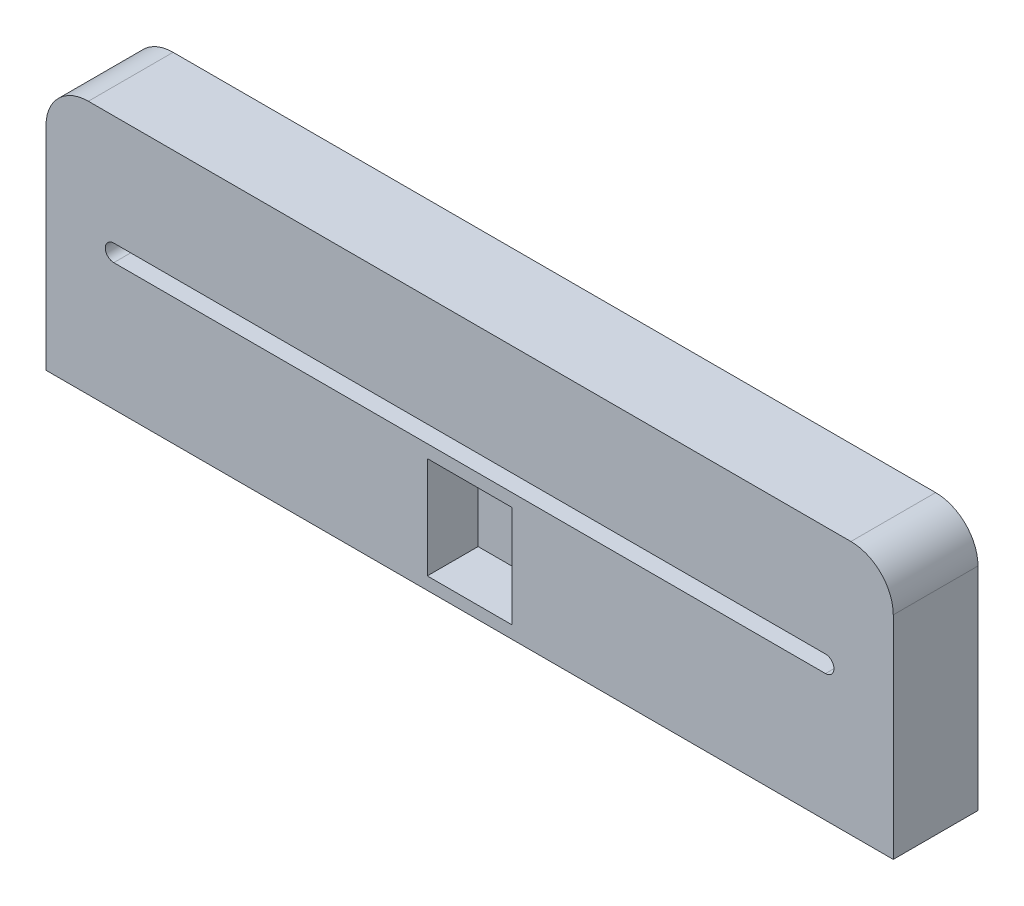
ISO-10303-21;
HEADER;
FILE_DESCRIPTION(('STEP AP214'),'2;1');
FILE_NAME('part.step','',(''),(''),'','','');
FILE_SCHEMA(('AUTOMOTIVE_DESIGN { 1 0 10303 214 1 1 1 1 }'));
ENDSEC;
DATA;
#1=APPLICATION_CONTEXT('core data for automotive mechanical design processes');
#2=APPLICATION_PROTOCOL_DEFINITION('international standard','automotive_design',2000,#1);
#3=PRODUCT_CONTEXT('',#1,'mechanical');
#4=PRODUCT('Part','Part','',(#3));
#5=PRODUCT_RELATED_PRODUCT_CATEGORY('part','',(#4));
#6=PRODUCT_DEFINITION_FORMATION('','',#4);
#7=PRODUCT_DEFINITION_CONTEXT('part definition',#1,'design');
#8=PRODUCT_DEFINITION('design','',#6,#7);
#9=PRODUCT_DEFINITION_SHAPE('','',#8);
#10=(LENGTH_UNIT() NAMED_UNIT(*) SI_UNIT(.MILLI.,.METRE.));
#11=(NAMED_UNIT(*) PLANE_ANGLE_UNIT() SI_UNIT($,.RADIAN.));
#12=(NAMED_UNIT(*) SI_UNIT($,.STERADIAN.) SOLID_ANGLE_UNIT());
#13=UNCERTAINTY_MEASURE_WITH_UNIT(LENGTH_MEASURE(1.E-05),#10,'distance_accuracy_value','');
#14=(GEOMETRIC_REPRESENTATION_CONTEXT(3) GLOBAL_UNCERTAINTY_ASSIGNED_CONTEXT((#13)) GLOBAL_UNIT_ASSIGNED_CONTEXT((#10,
#11,#12)) REPRESENTATION_CONTEXT('',''));
#15=CARTESIAN_POINT('',(0.,0.,0.));
#16=DIRECTION('',(0.,0.,1.));
#17=DIRECTION('',(1.,0.,0.));
#18=AXIS2_PLACEMENT_3D('',#15,#16,#17);
#19=CARTESIAN_POINT('',(25.,0.,5.));
#20=DIRECTION('',(1.,0.,0.));
#21=DIRECTION('',(0.,0.,-1.));
#22=AXIS2_PLACEMENT_3D('',#19,#20,#21);
#23=PLANE('',#22);
#24=DIRECTION('',(0.,-1.,0.));
#25=VECTOR('',#24,1.);
#26=CARTESIAN_POINT('',(25.,0.,0.));
#27=LINE('',#26,#25);
#28=CARTESIAN_POINT('',(25.,5.,0.));
#29=VERTEX_POINT('',#28);
#30=CARTESIAN_POINT('',(25.,-7.5,0.));
#31=VERTEX_POINT('',#30);
#32=EDGE_CURVE('E255',#29,#31,#27,.T.);
#33=ORIENTED_EDGE('',*,*,#32,.F.);
#34=DIRECTION('',(0.,0.,-1.));
#35=VECTOR('',#34,1.);
#36=CARTESIAN_POINT('',(25.,5.,5.));
#37=LINE('',#36,#35);
#38=CARTESIAN_POINT('',(25.,5.,5.));
#39=VERTEX_POINT('',#38);
#40=EDGE_CURVE('E11',#29,#39,#37,.F.);
#41=ORIENTED_EDGE('',*,*,#40,.T.);
#42=DIRECTION('',(0.,-1.,0.));
#43=VECTOR('',#42,1.);
#44=CARTESIAN_POINT('',(25.,0.,5.));
#45=LINE('',#44,#43);
#46=CARTESIAN_POINT('',(25.,-7.5,5.));
#47=VERTEX_POINT('',#46);
#48=EDGE_CURVE('E256',#39,#47,#45,.T.);
#49=ORIENTED_EDGE('',*,*,#48,.T.);
#50=DIRECTION('',(0.,0.,-1.));
#51=VECTOR('',#50,1.);
#52=CARTESIAN_POINT('',(25.,-7.5,5.));
#53=LINE('',#52,#51);
#54=EDGE_CURVE('E267',#47,#31,#53,.T.);
#55=ORIENTED_EDGE('',*,*,#54,.T.);
#56=EDGE_LOOP('',(#33,#41,#49,#55));
#57=FACE_BOUND('',#56,.T.);
#58=ADVANCED_FACE('F33',(#57),#23,.T.);
#59=CARTESIAN_POINT('',(0.,7.5,5.));
#60=DIRECTION('',(0.,1.,0.));
#61=DIRECTION('',(0.,0.,1.));
#62=AXIS2_PLACEMENT_3D('',#59,#60,#61);
#63=PLANE('',#62);
#64=DIRECTION('',(1.,0.,0.));
#65=VECTOR('',#64,1.);
#66=CARTESIAN_POINT('',(0.,7.5,0.));
#67=LINE('',#66,#65);
#68=CARTESIAN_POINT('',(-22.5,7.5,0.));
#69=VERTEX_POINT('',#68);
#70=CARTESIAN_POINT('',(22.5,7.5,0.));
#71=VERTEX_POINT('',#70);
#72=EDGE_CURVE('E269',#69,#71,#67,.T.);
#73=ORIENTED_EDGE('',*,*,#72,.F.);
#74=DIRECTION('',(0.,0.,-1.));
#75=VECTOR('',#74,1.);
#76=CARTESIAN_POINT('',(-22.5,7.5,5.));
#77=LINE('',#76,#75);
#78=CARTESIAN_POINT('',(-22.5,7.5,5.));
#79=VERTEX_POINT('',#78);
#80=EDGE_CURVE('E291',#69,#79,#77,.F.);
#81=ORIENTED_EDGE('',*,*,#80,.T.);
#82=DIRECTION('',(1.,0.,0.));
#83=VECTOR('',#82,1.);
#84=CARTESIAN_POINT('',(0.,7.5,5.));
#85=LINE('',#84,#83);
#86=CARTESIAN_POINT('',(22.5,7.5,5.));
#87=VERTEX_POINT('',#86);
#88=EDGE_CURVE('E258',#79,#87,#85,.T.);
#89=ORIENTED_EDGE('',*,*,#88,.T.);
#90=DIRECTION('',(0.,0.,-1.));
#91=VECTOR('',#90,1.);
#92=CARTESIAN_POINT('',(22.5,7.5,5.));
#93=LINE('',#92,#91);
#94=EDGE_CURVE('E288',#87,#71,#93,.T.);
#95=ORIENTED_EDGE('',*,*,#94,.T.);
#96=EDGE_LOOP('',(#73,#81,#89,#95));
#97=FACE_BOUND('',#96,.T.);
#98=ADVANCED_FACE('F313',(#97),#63,.T.);
#99=CARTESIAN_POINT('',(-25.,0.,5.));
#100=DIRECTION('',(1.,0.,0.));
#101=DIRECTION('',(0.,0.,-1.));
#102=AXIS2_PLACEMENT_3D('',#99,#100,#101);
#103=PLANE('',#102);
#104=DIRECTION('',(0.,-1.,0.));
#105=VECTOR('',#104,1.);
#106=CARTESIAN_POINT('',(-25.,0.,5.));
#107=LINE('',#106,#105);
#108=CARTESIAN_POINT('',(-25.,5.,5.));
#109=VERTEX_POINT('',#108);
#110=CARTESIAN_POINT('',(-25.,-7.5,5.));
#111=VERTEX_POINT('',#110);
#112=EDGE_CURVE('E262',#109,#111,#107,.T.);
#113=ORIENTED_EDGE('',*,*,#112,.F.);
#114=DIRECTION('',(0.,0.,-1.));
#115=VECTOR('',#114,1.);
#116=CARTESIAN_POINT('',(-25.,5.,0.));
#117=LINE('',#116,#115);
#118=CARTESIAN_POINT('',(-25.,5.,0.));
#119=VERTEX_POINT('',#118);
#120=EDGE_CURVE('E281',#109,#119,#117,.T.);
#121=ORIENTED_EDGE('',*,*,#120,.T.);
#122=DIRECTION('',(0.,-1.,0.));
#123=VECTOR('',#122,1.);
#124=CARTESIAN_POINT('',(-25.,0.,0.));
#125=LINE('',#124,#123);
#126=CARTESIAN_POINT('',(-25.,-7.5,0.));
#127=VERTEX_POINT('',#126);
#128=EDGE_CURVE('E272',#119,#127,#125,.T.);
#129=ORIENTED_EDGE('',*,*,#128,.T.);
#130=DIRECTION('',(0.,0.,-1.));
#131=VECTOR('',#130,1.);
#132=CARTESIAN_POINT('',(-25.,-7.5,5.));
#133=LINE('',#132,#131);
#134=EDGE_CURVE('E278',#111,#127,#133,.T.);
#135=ORIENTED_EDGE('',*,*,#134,.F.);
#136=EDGE_LOOP('',(#113,#121,#129,#135));
#137=FACE_BOUND('',#136,.T.);
#138=ADVANCED_FACE('F304',(#137),#103,.F.);
#139=CARTESIAN_POINT('',(0.,-7.5,5.));
#140=DIRECTION('',(0.,1.,0.));
#141=DIRECTION('',(0.,0.,1.));
#142=AXIS2_PLACEMENT_3D('',#139,#140,#141);
#143=PLANE('',#142);
#144=DIRECTION('',(1.,0.,0.));
#145=VECTOR('',#144,1.);
#146=CARTESIAN_POINT('',(0.,-7.5,0.));
#147=LINE('',#146,#145);
#148=EDGE_CURVE('E259',#127,#31,#147,.T.);
#149=ORIENTED_EDGE('',*,*,#148,.T.);
#150=ORIENTED_EDGE('',*,*,#54,.F.);
#151=DIRECTION('',(1.,0.,0.));
#152=VECTOR('',#151,1.);
#153=CARTESIAN_POINT('',(0.,-7.5,5.));
#154=LINE('',#153,#152);
#155=EDGE_CURVE('E264',#111,#47,#154,.T.);
#156=ORIENTED_EDGE('',*,*,#155,.F.);
#157=ORIENTED_EDGE('',*,*,#134,.T.);
#158=EDGE_LOOP('',(#149,#150,#156,#157));
#159=FACE_BOUND('',#158,.T.);
#160=ADVANCED_FACE('F323',(#159),#143,.F.);
#161=CARTESIAN_POINT('',(0.,0.,5.));
#162=DIRECTION('',(0.,0.,1.));
#163=DIRECTION('',(1.,0.,0.));
#164=AXIS2_PLACEMENT_3D('',#161,#162,#163);
#165=PLANE('',#164);
#166=DIRECTION('',(0.,1.,0.));
#167=VECTOR('',#166,1.);
#168=CARTESIAN_POINT('',(2.5,-0.760126057706259,5.));
#169=LINE('',#168,#167);
#170=CARTESIAN_POINT('',(2.5,-6.76012605770626,5.));
#171=VERTEX_POINT('',#170);
#172=CARTESIAN_POINT('',(2.5,-0.760126057706259,5.));
#173=VERTEX_POINT('',#172);
#174=EDGE_CURVE('E48',#171,#173,#169,.T.);
#175=ORIENTED_EDGE('',*,*,#174,.F.);
#176=DIRECTION('',(1.,0.,0.));
#177=VECTOR('',#176,1.);
#178=CARTESIAN_POINT('',(-2.5,-6.76012605770626,5.));
#179=LINE('',#178,#177);
#180=CARTESIAN_POINT('',(-2.5,-6.76012605770626,5.));
#181=VERTEX_POINT('',#180);
#182=EDGE_CURVE('E177',#181,#171,#179,.T.);
#183=ORIENTED_EDGE('',*,*,#182,.F.);
#184=DIRECTION('',(0.,-1.,0.));
#185=VECTOR('',#184,1.);
#186=CARTESIAN_POINT('',(-2.5,-0.760126057706259,5.));
#187=LINE('',#186,#185);
#188=CARTESIAN_POINT('',(-2.5,-0.760126057706259,5.));
#189=VERTEX_POINT('',#188);
#190=EDGE_CURVE('E180',#189,#181,#187,.T.);
#191=ORIENTED_EDGE('',*,*,#190,.F.);
#192=DIRECTION('',(-1.,0.,0.));
#193=VECTOR('',#192,1.);
#194=CARTESIAN_POINT('',(-2.5,-0.760126057706259,5.));
#195=LINE('',#194,#193);
#196=EDGE_CURVE('E186',#173,#189,#195,.T.);
#197=ORIENTED_EDGE('',*,*,#196,.F.);
#198=EDGE_LOOP('',(#175,#183,#191,#197));
#199=FACE_BOUND('',#198,.T.);
#200=CARTESIAN_POINT('',(21.,0.500000000000001,5.));
#201=DIRECTION('',(0.,0.,-1.));
#202=DIRECTION('',(-1.,0.,0.));
#203=AXIS2_PLACEMENT_3D('',#200,#201,#202);
#204=CIRCLE('',#203,0.5);
#205=CARTESIAN_POINT('',(21.,1.,5.));
#206=VERTEX_POINT('',#205);
#207=CARTESIAN_POINT('',(21.,0.,5.));
#208=VERTEX_POINT('',#207);
#209=EDGE_CURVE('E196',#206,#208,#204,.T.);
#210=ORIENTED_EDGE('',*,*,#209,.T.);
#211=DIRECTION('',(-1.,0.,0.));
#212=VECTOR('',#211,1.);
#213=CARTESIAN_POINT('',(21.,0.,5.));
#214=LINE('',#213,#212);
#215=CARTESIAN_POINT('',(-21.,0.,5.));
#216=VERTEX_POINT('',#215);
#217=EDGE_CURVE('E199',#208,#216,#214,.T.);
#218=ORIENTED_EDGE('',*,*,#217,.T.);
#219=CARTESIAN_POINT('',(-21.,0.500000000000001,5.));
#220=DIRECTION('',(0.,0.,-1.));
#221=DIRECTION('',(-1.,0.,0.));
#222=AXIS2_PLACEMENT_3D('',#219,#220,#221);
#223=CIRCLE('',#222,0.5);
#224=CARTESIAN_POINT('',(-21.,1.,5.));
#225=VERTEX_POINT('',#224);
#226=EDGE_CURVE('E56',#216,#225,#223,.T.);
#227=ORIENTED_EDGE('',*,*,#226,.T.);
#228=DIRECTION('',(1.,0.,0.));
#229=VECTOR('',#228,1.);
#230=CARTESIAN_POINT('',(21.,1.,5.));
#231=LINE('',#230,#229);
#232=EDGE_CURVE('E204',#225,#206,#231,.T.);
#233=ORIENTED_EDGE('',*,*,#232,.T.);
#234=EDGE_LOOP('',(#210,#218,#227,#233));
#235=FACE_BOUND('',#234,.T.);
#236=ORIENTED_EDGE('',*,*,#88,.F.);
#237=CARTESIAN_POINT('',(-22.5,5.,5.));
#238=DIRECTION('',(0.,0.,1.));
#239=DIRECTION('',(1.,0.,0.));
#240=AXIS2_PLACEMENT_3D('',#237,#238,#239);
#241=CIRCLE('',#240,2.5);
#242=EDGE_CURVE('E41',#79,#109,#241,.T.);
#243=ORIENTED_EDGE('',*,*,#242,.T.);
#244=ORIENTED_EDGE('',*,*,#112,.T.);
#245=ORIENTED_EDGE('',*,*,#155,.T.);
#246=ORIENTED_EDGE('',*,*,#48,.F.);
#247=CARTESIAN_POINT('',(22.5,5.,5.));
#248=DIRECTION('',(0.,0.,1.));
#249=DIRECTION('',(1.,0.,0.));
#250=AXIS2_PLACEMENT_3D('',#247,#248,#249);
#251=CIRCLE('',#250,2.5);
#252=EDGE_CURVE('E293',#39,#87,#251,.T.);
#253=ORIENTED_EDGE('',*,*,#252,.T.);
#254=EDGE_LOOP('',(#236,#243,#244,#245,#246,#253));
#255=FACE_BOUND('',#254,.T.);
#256=ADVANCED_FACE('F298',(#199,#235,#255),#165,.T.);
#257=CARTESIAN_POINT('',(0.,0.,0.));
#258=DIRECTION('',(0.,0.,1.));
#259=DIRECTION('',(1.,0.,0.));
#260=AXIS2_PLACEMENT_3D('',#257,#258,#259);
#261=PLANE('',#260);
#262=DIRECTION('',(1.,0.,0.));
#263=VECTOR('',#262,1.);
#264=CARTESIAN_POINT('',(0.,-0.499999999999999,0.));
#265=LINE('',#264,#263);
#266=CARTESIAN_POINT('',(-22.,-0.499999999999999,0.));
#267=VERTEX_POINT('',#266);
#268=CARTESIAN_POINT('',(22.,-0.499999999999999,0.));
#269=VERTEX_POINT('',#268);
#270=EDGE_CURVE('E230',#267,#269,#265,.T.);
#271=ORIENTED_EDGE('',*,*,#270,.T.);
#272=DIRECTION('',(0.,-1.,0.));
#273=VECTOR('',#272,1.);
#274=CARTESIAN_POINT('',(22.,0.,0.));
#275=LINE('',#274,#273);
#276=CARTESIAN_POINT('',(22.,4.5,0.));
#277=VERTEX_POINT('',#276);
#278=EDGE_CURVE('E219',#277,#269,#275,.T.);
#279=ORIENTED_EDGE('',*,*,#278,.F.);
#280=DIRECTION('',(1.,0.,0.));
#281=VECTOR('',#280,1.);
#282=CARTESIAN_POINT('',(0.,4.5,0.));
#283=LINE('',#282,#281);
#284=CARTESIAN_POINT('',(-22.,4.5,0.));
#285=VERTEX_POINT('',#284);
#286=EDGE_CURVE('E239',#285,#277,#283,.T.);
#287=ORIENTED_EDGE('',*,*,#286,.F.);
#288=DIRECTION('',(0.,-1.,0.));
#289=VECTOR('',#288,1.);
#290=CARTESIAN_POINT('',(-22.,0.,0.));
#291=LINE('',#290,#289);
#292=EDGE_CURVE('E242',#285,#267,#291,.T.);
#293=ORIENTED_EDGE('',*,*,#292,.T.);
#294=EDGE_LOOP('',(#271,#279,#287,#293));
#295=FACE_BOUND('',#294,.T.);
#296=ORIENTED_EDGE('',*,*,#128,.F.);
#297=CARTESIAN_POINT('',(-22.5,5.,0.));
#298=DIRECTION('',(0.,0.,1.));
#299=DIRECTION('',(1.,0.,0.));
#300=AXIS2_PLACEMENT_3D('',#297,#298,#299);
#301=CIRCLE('',#300,2.5);
#302=EDGE_CURVE('E286',#119,#69,#301,.F.);
#303=ORIENTED_EDGE('',*,*,#302,.T.);
#304=ORIENTED_EDGE('',*,*,#72,.T.);
#305=CARTESIAN_POINT('',(22.5,5.,0.));
#306=DIRECTION('',(0.,0.,1.));
#307=DIRECTION('',(1.,0.,0.));
#308=AXIS2_PLACEMENT_3D('',#305,#306,#307);
#309=CIRCLE('',#308,2.5);
#310=EDGE_CURVE('E284',#71,#29,#309,.F.);
#311=ORIENTED_EDGE('',*,*,#310,.T.);
#312=ORIENTED_EDGE('',*,*,#32,.T.);
#313=ORIENTED_EDGE('',*,*,#148,.F.);
#314=EDGE_LOOP('',(#296,#303,#304,#311,#312,#313));
#315=FACE_BOUND('',#314,.T.);
#316=ADVANCED_FACE('F310',(#295,#315),#261,.F.);
#317=CARTESIAN_POINT('',(22.,0.,2.));
#318=DIRECTION('',(1.,0.,0.));
#319=DIRECTION('',(0.,0.,-1.));
#320=AXIS2_PLACEMENT_3D('',#317,#318,#319);
#321=PLANE('',#320);
#322=ORIENTED_EDGE('',*,*,#278,.T.);
#323=DIRECTION('',(0.,0.,-1.));
#324=VECTOR('',#323,1.);
#325=CARTESIAN_POINT('',(22.,-0.499999999999999,2.));
#326=LINE('',#325,#324);
#327=CARTESIAN_POINT('',(22.,-0.499999999999999,2.));
#328=VERTEX_POINT('',#327);
#329=EDGE_CURVE('E237',#328,#269,#326,.T.);
#330=ORIENTED_EDGE('',*,*,#329,.F.);
#331=DIRECTION('',(0.,-1.,0.));
#332=VECTOR('',#331,1.);
#333=CARTESIAN_POINT('',(22.,0.,2.));
#334=LINE('',#333,#332);
#335=CARTESIAN_POINT('',(22.,4.5,2.));
#336=VERTEX_POINT('',#335);
#337=EDGE_CURVE('E226',#336,#328,#334,.T.);
#338=ORIENTED_EDGE('',*,*,#337,.F.);
#339=DIRECTION('',(0.,0.,-1.));
#340=VECTOR('',#339,1.);
#341=CARTESIAN_POINT('',(22.,4.5,2.));
#342=LINE('',#341,#340);
#343=EDGE_CURVE('E253',#336,#277,#342,.T.);
#344=ORIENTED_EDGE('',*,*,#343,.T.);
#345=EDGE_LOOP('',(#322,#330,#338,#344));
#346=FACE_BOUND('',#345,.T.);
#347=ADVANCED_FACE('F367',(#346),#321,.F.);
#348=CARTESIAN_POINT('',(0.,4.5,2.));
#349=DIRECTION('',(0.,1.,0.));
#350=DIRECTION('',(0.,0.,1.));
#351=AXIS2_PLACEMENT_3D('',#348,#349,#350);
#352=PLANE('',#351);
#353=ORIENTED_EDGE('',*,*,#286,.T.);
#354=ORIENTED_EDGE('',*,*,#343,.F.);
#355=DIRECTION('',(1.,0.,0.));
#356=VECTOR('',#355,1.);
#357=CARTESIAN_POINT('',(0.,4.5,2.));
#358=LINE('',#357,#356);
#359=CARTESIAN_POINT('',(-22.,4.5,2.));
#360=VERTEX_POINT('',#359);
#361=EDGE_CURVE('E229',#360,#336,#358,.T.);
#362=ORIENTED_EDGE('',*,*,#361,.F.);
#363=DIRECTION('',(0.,0.,-1.));
#364=VECTOR('',#363,1.);
#365=CARTESIAN_POINT('',(-22.,4.5,2.));
#366=LINE('',#365,#364);
#367=EDGE_CURVE('E251',#360,#285,#366,.T.);
#368=ORIENTED_EDGE('',*,*,#367,.T.);
#369=EDGE_LOOP('',(#353,#354,#362,#368));
#370=FACE_BOUND('',#369,.T.);
#371=ADVANCED_FACE('F363',(#370),#352,.F.);
#372=CARTESIAN_POINT('',(-22.,0.,2.));
#373=DIRECTION('',(1.,0.,0.));
#374=DIRECTION('',(0.,0.,-1.));
#375=AXIS2_PLACEMENT_3D('',#372,#373,#374);
#376=PLANE('',#375);
#377=ORIENTED_EDGE('',*,*,#292,.F.);
#378=ORIENTED_EDGE('',*,*,#367,.F.);
#379=DIRECTION('',(0.,-1.,0.));
#380=VECTOR('',#379,1.);
#381=CARTESIAN_POINT('',(-22.,0.,2.));
#382=LINE('',#381,#380);
#383=CARTESIAN_POINT('',(-22.,-0.499999999999999,2.));
#384=VERTEX_POINT('',#383);
#385=EDGE_CURVE('E233',#360,#384,#382,.T.);
#386=ORIENTED_EDGE('',*,*,#385,.T.);
#387=DIRECTION('',(0.,0.,-1.));
#388=VECTOR('',#387,1.);
#389=CARTESIAN_POINT('',(-22.,-0.499999999999999,2.));
#390=LINE('',#389,#388);
#391=EDGE_CURVE('E249',#384,#267,#390,.T.);
#392=ORIENTED_EDGE('',*,*,#391,.T.);
#393=EDGE_LOOP('',(#377,#378,#386,#392));
#394=FACE_BOUND('',#393,.T.);
#395=ADVANCED_FACE('F353',(#394),#376,.T.);
#396=CARTESIAN_POINT('',(0.,-0.499999999999999,2.));
#397=DIRECTION('',(0.,1.,0.));
#398=DIRECTION('',(0.,0.,1.));
#399=AXIS2_PLACEMENT_3D('',#396,#397,#398);
#400=PLANE('',#399);
#401=ORIENTED_EDGE('',*,*,#270,.F.);
#402=ORIENTED_EDGE('',*,*,#391,.F.);
#403=DIRECTION('',(1.,0.,0.));
#404=VECTOR('',#403,1.);
#405=CARTESIAN_POINT('',(0.,-0.499999999999999,2.));
#406=LINE('',#405,#404);
#407=EDGE_CURVE('E235',#384,#328,#406,.T.);
#408=ORIENTED_EDGE('',*,*,#407,.T.);
#409=ORIENTED_EDGE('',*,*,#329,.T.);
#410=EDGE_LOOP('',(#401,#402,#408,#409));
#411=FACE_BOUND('',#410,.T.);
#412=ADVANCED_FACE('F347',(#411),#400,.T.);
#413=CARTESIAN_POINT('',(0.,0.,2.));
#414=DIRECTION('',(0.,0.,1.));
#415=DIRECTION('',(1.,0.,0.));
#416=AXIS2_PLACEMENT_3D('',#413,#414,#415);
#417=PLANE('',#416);
#418=DIRECTION('',(-1.,0.,0.));
#419=VECTOR('',#418,1.);
#420=CARTESIAN_POINT('',(21.,0.,2.));
#421=LINE('',#420,#419);
#422=CARTESIAN_POINT('',(21.,0.,2.));
#423=VERTEX_POINT('',#422);
#424=CARTESIAN_POINT('',(-21.,0.,2.));
#425=VERTEX_POINT('',#424);
#426=EDGE_CURVE('E209',#423,#425,#421,.T.);
#427=ORIENTED_EDGE('',*,*,#426,.F.);
#428=CARTESIAN_POINT('',(21.,0.500000000000001,2.));
#429=DIRECTION('',(0.,0.,-1.));
#430=DIRECTION('',(-1.,0.,0.));
#431=AXIS2_PLACEMENT_3D('',#428,#429,#430);
#432=CIRCLE('',#431,0.5);
#433=CARTESIAN_POINT('',(21.,1.,2.));
#434=VERTEX_POINT('',#433);
#435=EDGE_CURVE('E192',#434,#423,#432,.T.);
#436=ORIENTED_EDGE('',*,*,#435,.F.);
#437=DIRECTION('',(1.,0.,0.));
#438=VECTOR('',#437,1.);
#439=CARTESIAN_POINT('',(21.,1.,2.));
#440=LINE('',#439,#438);
#441=CARTESIAN_POINT('',(-21.,1.,2.));
#442=VERTEX_POINT('',#441);
#443=EDGE_CURVE('E200',#442,#434,#440,.T.);
#444=ORIENTED_EDGE('',*,*,#443,.F.);
#445=CARTESIAN_POINT('',(-21.,0.500000000000001,2.));
#446=DIRECTION('',(0.,0.,-1.));
#447=DIRECTION('',(-1.,0.,0.));
#448=AXIS2_PLACEMENT_3D('',#445,#446,#447);
#449=CIRCLE('',#448,0.5);
#450=EDGE_CURVE('E212',#425,#442,#449,.T.);
#451=ORIENTED_EDGE('',*,*,#450,.F.);
#452=EDGE_LOOP('',(#427,#436,#444,#451));
#453=FACE_BOUND('',#452,.T.);
#454=ORIENTED_EDGE('',*,*,#337,.T.);
#455=ORIENTED_EDGE('',*,*,#407,.F.);
#456=ORIENTED_EDGE('',*,*,#385,.F.);
#457=ORIENTED_EDGE('',*,*,#361,.T.);
#458=EDGE_LOOP('',(#454,#455,#456,#457));
#459=FACE_BOUND('',#458,.T.);
#460=ADVANCED_FACE('F341',(#453,#459),#417,.F.);
#461=CARTESIAN_POINT('',(-22.5,5.,5.));
#462=DIRECTION('',(0.,0.,1.));
#463=DIRECTION('',(1.,0.,0.));
#464=AXIS2_PLACEMENT_3D('',#461,#462,#463);
#465=CYLINDRICAL_SURFACE('',#464,2.5);
#466=ORIENTED_EDGE('',*,*,#242,.F.);
#467=ORIENTED_EDGE('',*,*,#80,.F.);
#468=ORIENTED_EDGE('',*,*,#302,.F.);
#469=ORIENTED_EDGE('',*,*,#120,.F.);
#470=EDGE_LOOP('',(#466,#467,#468,#469));
#471=FACE_BOUND('',#470,.T.);
#472=ADVANCED_FACE('F307',(#471),#465,.T.);
#473=CARTESIAN_POINT('',(22.5,5.,5.));
#474=DIRECTION('',(0.,0.,-1.));
#475=DIRECTION('',(-1.,0.,0.));
#476=AXIS2_PLACEMENT_3D('',#473,#474,#475);
#477=CYLINDRICAL_SURFACE('',#476,2.5);
#478=ORIENTED_EDGE('',*,*,#252,.F.);
#479=ORIENTED_EDGE('',*,*,#40,.F.);
#480=ORIENTED_EDGE('',*,*,#310,.F.);
#481=ORIENTED_EDGE('',*,*,#94,.F.);
#482=EDGE_LOOP('',(#478,#479,#480,#481));
#483=FACE_BOUND('',#482,.T.);
#484=ADVANCED_FACE('F35',(#483),#477,.T.);
#485=CARTESIAN_POINT('',(21.,0.500000000000001,5.));
#486=DIRECTION('',(0.,0.,-1.));
#487=DIRECTION('',(-1.,0.,0.));
#488=AXIS2_PLACEMENT_3D('',#485,#486,#487);
#489=CYLINDRICAL_SURFACE('',#488,0.5);
#490=ORIENTED_EDGE('',*,*,#435,.T.);
#491=DIRECTION('',(0.,0.,-1.));
#492=VECTOR('',#491,1.);
#493=CARTESIAN_POINT('',(21.,0.,5.));
#494=LINE('',#493,#492);
#495=EDGE_CURVE('E207',#208,#423,#494,.T.);
#496=ORIENTED_EDGE('',*,*,#495,.F.);
#497=ORIENTED_EDGE('',*,*,#209,.F.);
#498=DIRECTION('',(0.,0.,-1.));
#499=VECTOR('',#498,1.);
#500=CARTESIAN_POINT('',(21.,1.,5.));
#501=LINE('',#500,#499);
#502=EDGE_CURVE('E217',#206,#434,#501,.T.);
#503=ORIENTED_EDGE('',*,*,#502,.T.);
#504=EDGE_LOOP('',(#490,#496,#497,#503));
#505=FACE_BOUND('',#504,.T.);
#506=ADVANCED_FACE('F346',(#505),#489,.F.);
#507=CARTESIAN_POINT('',(21.,1.,5.));
#508=DIRECTION('',(0.,1.,0.));
#509=DIRECTION('',(0.,0.,1.));
#510=AXIS2_PLACEMENT_3D('',#507,#508,#509);
#511=PLANE('',#510);
#512=ORIENTED_EDGE('',*,*,#443,.T.);
#513=ORIENTED_EDGE('',*,*,#502,.F.);
#514=ORIENTED_EDGE('',*,*,#232,.F.);
#515=DIRECTION('',(0.,0.,-1.));
#516=VECTOR('',#515,1.);
#517=CARTESIAN_POINT('',(-21.,1.,5.));
#518=LINE('',#517,#516);
#519=EDGE_CURVE('E220',#225,#442,#518,.T.);
#520=ORIENTED_EDGE('',*,*,#519,.T.);
#521=EDGE_LOOP('',(#512,#513,#514,#520));
#522=FACE_BOUND('',#521,.T.);
#523=ADVANCED_FACE('F491',(#522),#511,.F.);
#524=CARTESIAN_POINT('',(-21.,0.500000000000001,5.));
#525=DIRECTION('',(0.,0.,-1.));
#526=DIRECTION('',(-1.,0.,0.));
#527=AXIS2_PLACEMENT_3D('',#524,#525,#526);
#528=CYLINDRICAL_SURFACE('',#527,0.5);
#529=ORIENTED_EDGE('',*,*,#450,.T.);
#530=ORIENTED_EDGE('',*,*,#519,.F.);
#531=ORIENTED_EDGE('',*,*,#226,.F.);
#532=DIRECTION('',(0.,0.,-1.));
#533=VECTOR('',#532,1.);
#534=CARTESIAN_POINT('',(-21.,0.,5.));
#535=LINE('',#534,#533);
#536=EDGE_CURVE('E222',#216,#425,#535,.T.);
#537=ORIENTED_EDGE('',*,*,#536,.T.);
#538=EDGE_LOOP('',(#529,#530,#531,#537));
#539=FACE_BOUND('',#538,.T.);
#540=ADVANCED_FACE('F494',(#539),#528,.F.);
#541=CARTESIAN_POINT('',(21.,0.,5.));
#542=DIRECTION('',(0.,-1.,0.));
#543=DIRECTION('',(0.,0.,-1.));
#544=AXIS2_PLACEMENT_3D('',#541,#542,#543);
#545=PLANE('',#544);
#546=ORIENTED_EDGE('',*,*,#426,.T.);
#547=ORIENTED_EDGE('',*,*,#536,.F.);
#548=ORIENTED_EDGE('',*,*,#217,.F.);
#549=ORIENTED_EDGE('',*,*,#495,.T.);
#550=EDGE_LOOP('',(#546,#547,#548,#549));
#551=FACE_BOUND('',#550,.T.);
#552=ADVANCED_FACE('F442',(#551),#545,.F.);
#553=CARTESIAN_POINT('',(2.5,-0.760126057706259,2.));
#554=DIRECTION('',(1.,0.,0.));
#555=DIRECTION('',(0.,1.,0.));
#556=AXIS2_PLACEMENT_3D('',#553,#554,#555);
#557=PLANE('',#556);
#558=ORIENTED_EDGE('',*,*,#174,.T.);
#559=DIRECTION('',(0.,0.,1.));
#560=VECTOR('',#559,1.);
#561=CARTESIAN_POINT('',(2.5,-0.760126057706259,2.));
#562=LINE('',#561,#560);
#563=CARTESIAN_POINT('',(2.5,-0.760126057706259,2.));
#564=VERTEX_POINT('',#563);
#565=EDGE_CURVE('E155',#564,#173,#562,.T.);
#566=ORIENTED_EDGE('',*,*,#565,.F.);
#567=DIRECTION('',(0.,1.,0.));
#568=VECTOR('',#567,1.);
#569=CARTESIAN_POINT('',(2.5,-0.760126057706259,2.));
#570=LINE('',#569,#568);
#571=CARTESIAN_POINT('',(2.5,-6.76012605770626,2.));
#572=VERTEX_POINT('',#571);
#573=EDGE_CURVE('E159',#572,#564,#570,.T.);
#574=ORIENTED_EDGE('',*,*,#573,.F.);
#575=DIRECTION('',(0.,0.,1.));
#576=VECTOR('',#575,1.);
#577=CARTESIAN_POINT('',(2.5,-6.76012605770626,2.));
#578=LINE('',#577,#576);
#579=EDGE_CURVE('E190',#572,#171,#578,.T.);
#580=ORIENTED_EDGE('',*,*,#579,.T.);
#581=EDGE_LOOP('',(#558,#566,#574,#580));
#582=FACE_BOUND('',#581,.T.);
#583=ADVANCED_FACE('F157',(#582),#557,.F.);
#584=CARTESIAN_POINT('',(-2.5,-6.76012605770626,2.));
#585=DIRECTION('',(0.,-1.,0.));
#586=DIRECTION('',(0.,0.,-1.));
#587=AXIS2_PLACEMENT_3D('',#584,#585,#586);
#588=PLANE('',#587);
#589=ORIENTED_EDGE('',*,*,#182,.T.);
#590=ORIENTED_EDGE('',*,*,#579,.F.);
#591=DIRECTION('',(1.,0.,0.));
#592=VECTOR('',#591,1.);
#593=CARTESIAN_POINT('',(-2.5,-6.76012605770626,2.));
#594=LINE('',#593,#592);
#595=CARTESIAN_POINT('',(-2.5,-6.76012605770626,2.));
#596=VERTEX_POINT('',#595);
#597=EDGE_CURVE('E165',#596,#572,#594,.T.);
#598=ORIENTED_EDGE('',*,*,#597,.F.);
#599=DIRECTION('',(0.,0.,1.));
#600=VECTOR('',#599,1.);
#601=CARTESIAN_POINT('',(-2.5,-6.76012605770626,2.));
#602=LINE('',#601,#600);
#603=EDGE_CURVE('E193',#596,#181,#602,.T.);
#604=ORIENTED_EDGE('',*,*,#603,.T.);
#605=EDGE_LOOP('',(#589,#590,#598,#604));
#606=FACE_BOUND('',#605,.T.);
#607=ADVANCED_FACE('F451',(#606),#588,.F.);
#608=CARTESIAN_POINT('',(-2.5,-0.760126057706259,2.));
#609=DIRECTION('',(-1.,0.,0.));
#610=DIRECTION('',(0.,-1.,0.));
#611=AXIS2_PLACEMENT_3D('',#608,#609,#610);
#612=PLANE('',#611);
#613=ORIENTED_EDGE('',*,*,#190,.T.);
#614=ORIENTED_EDGE('',*,*,#603,.F.);
#615=DIRECTION('',(0.,-1.,0.));
#616=VECTOR('',#615,1.);
#617=CARTESIAN_POINT('',(-2.5,-0.760126057706259,2.));
#618=LINE('',#617,#616);
#619=CARTESIAN_POINT('',(-2.5,-0.760126057706259,2.));
#620=VERTEX_POINT('',#619);
#621=EDGE_CURVE('E173',#620,#596,#618,.T.);
#622=ORIENTED_EDGE('',*,*,#621,.F.);
#623=DIRECTION('',(0.,0.,1.));
#624=VECTOR('',#623,1.);
#625=CARTESIAN_POINT('',(-2.5,-0.760126057706259,2.));
#626=LINE('',#625,#624);
#627=EDGE_CURVE('E164',#620,#189,#626,.T.);
#628=ORIENTED_EDGE('',*,*,#627,.T.);
#629=EDGE_LOOP('',(#613,#614,#622,#628));
#630=FACE_BOUND('',#629,.T.);
#631=ADVANCED_FACE('F460',(#630),#612,.F.);
#632=CARTESIAN_POINT('',(-2.5,-0.760126057706259,2.));
#633=DIRECTION('',(0.,1.,0.));
#634=DIRECTION('',(-1.,0.,0.));
#635=AXIS2_PLACEMENT_3D('',#632,#633,#634);
#636=PLANE('',#635);
#637=ORIENTED_EDGE('',*,*,#196,.T.);
#638=ORIENTED_EDGE('',*,*,#627,.F.);
#639=DIRECTION('',(-1.,0.,0.));
#640=VECTOR('',#639,1.);
#641=CARTESIAN_POINT('',(-2.5,-0.760126057706259,2.));
#642=LINE('',#641,#640);
#643=EDGE_CURVE('E168',#564,#620,#642,.T.);
#644=ORIENTED_EDGE('',*,*,#643,.F.);
#645=ORIENTED_EDGE('',*,*,#565,.T.);
#646=EDGE_LOOP('',(#637,#638,#644,#645));
#647=FACE_BOUND('',#646,.T.);
#648=ADVANCED_FACE('F169',(#647),#636,.F.);
#649=CARTESIAN_POINT('',(0.,0.,2.));
#650=DIRECTION('',(0.,0.,1.));
#651=DIRECTION('',(1.,0.,0.));
#652=AXIS2_PLACEMENT_3D('',#649,#650,#651);
#653=PLANE('',#652);
#654=ORIENTED_EDGE('',*,*,#573,.T.);
#655=ORIENTED_EDGE('',*,*,#643,.T.);
#656=ORIENTED_EDGE('',*,*,#621,.T.);
#657=ORIENTED_EDGE('',*,*,#597,.T.);
#658=EDGE_LOOP('',(#654,#655,#656,#657));
#659=FACE_BOUND('',#658,.T.);
#660=ADVANCED_FACE('F175',(#659),#653,.T.);
#661=CLOSED_SHELL('',(#58,#98,#138,#160,#256,#316,#347,#371,#395,#412,#460,#472,#484,#506,#523,
#540,#552,#583,#607,#631,#648,#660));
#662=MANIFOLD_SOLID_BREP('B2',#661);
#663=ADVANCED_BREP_SHAPE_REPRESENTATION('',(#18,#662),#14);
#664=SHAPE_DEFINITION_REPRESENTATION(#9,#663);
ENDSEC;
END-ISO-10303-21;
